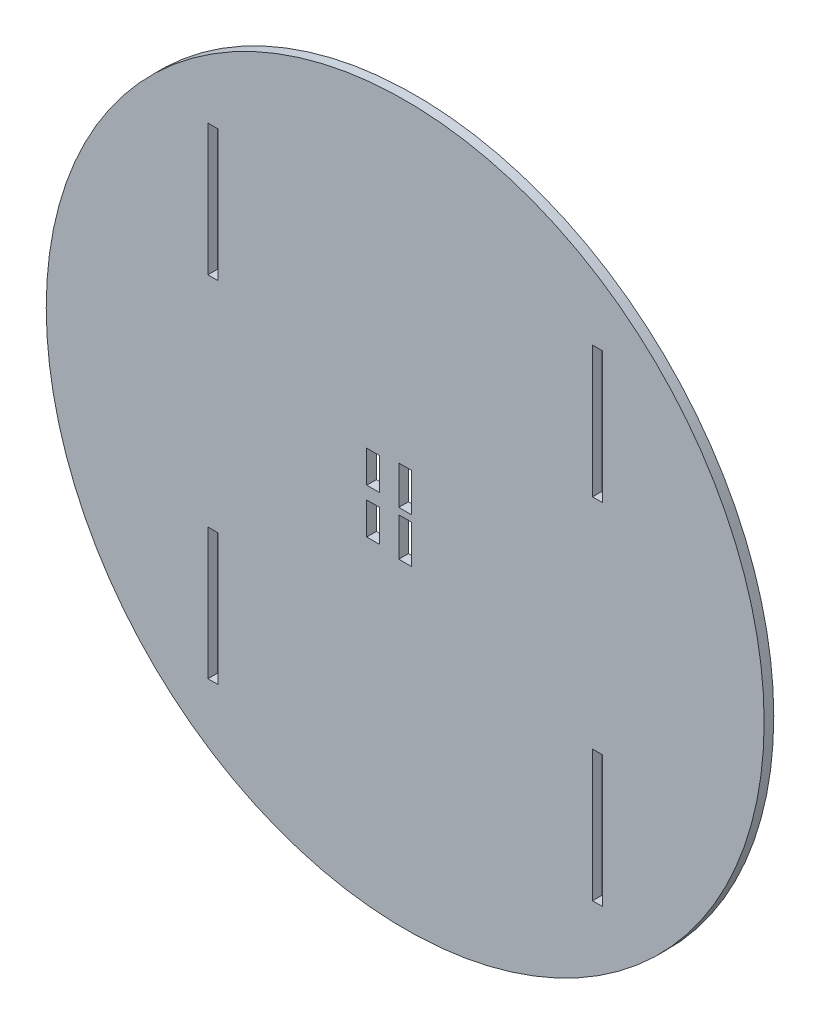
ISO-10303-21;
HEADER;
FILE_DESCRIPTION(('STEP AP214'),'2;1');
FILE_NAME('part.step','',(''),(''),'','','');
FILE_SCHEMA(('AUTOMOTIVE_DESIGN { 1 0 10303 214 1 1 1 1 }'));
ENDSEC;
DATA;
#1=APPLICATION_CONTEXT('core data for automotive mechanical design processes');
#2=APPLICATION_PROTOCOL_DEFINITION('international standard','automotive_design',2000,#1);
#3=PRODUCT_CONTEXT('',#1,'mechanical');
#4=PRODUCT('Part','Part','',(#3));
#5=PRODUCT_RELATED_PRODUCT_CATEGORY('part','',(#4));
#6=PRODUCT_DEFINITION_FORMATION('','',#4);
#7=PRODUCT_DEFINITION_CONTEXT('part definition',#1,'design');
#8=PRODUCT_DEFINITION('design','',#6,#7);
#9=PRODUCT_DEFINITION_SHAPE('','',#8);
#10=(LENGTH_UNIT() NAMED_UNIT(*) SI_UNIT(.MILLI.,.METRE.));
#11=(NAMED_UNIT(*) PLANE_ANGLE_UNIT() SI_UNIT($,.RADIAN.));
#12=(NAMED_UNIT(*) SI_UNIT($,.STERADIAN.) SOLID_ANGLE_UNIT());
#13=UNCERTAINTY_MEASURE_WITH_UNIT(LENGTH_MEASURE(1.E-05),#10,'distance_accuracy_value','');
#14=(GEOMETRIC_REPRESENTATION_CONTEXT(3) GLOBAL_UNCERTAINTY_ASSIGNED_CONTEXT((#13)) GLOBAL_UNIT_ASSIGNED_CONTEXT((#10,
#11,#12)) REPRESENTATION_CONTEXT('',''));
#15=CARTESIAN_POINT('',(0.,0.,0.));
#16=DIRECTION('',(0.,0.,1.));
#17=DIRECTION('',(1.,0.,0.));
#18=AXIS2_PLACEMENT_3D('',#15,#16,#17);
#19=CARTESIAN_POINT('',(0.,0.,1.5));
#20=DIRECTION('',(0.,0.,1.));
#21=DIRECTION('',(1.,0.,0.));
#22=AXIS2_PLACEMENT_3D('',#19,#20,#21);
#23=PLANE('',#22);
#24=CARTESIAN_POINT('',(0.,0.,1.5));
#25=DIRECTION('',(0.,0.,1.));
#26=DIRECTION('',(1.,0.,0.));
#27=AXIS2_PLACEMENT_3D('',#24,#25,#26);
#28=CIRCLE('',#27,112.);
#29=CARTESIAN_POINT('',(112.,0.,1.5));
#30=VERTEX_POINT('',#29);
#31=EDGE_CURVE('E11',#30,#30,#28,.T.);
#32=ORIENTED_EDGE('',*,*,#31,.T.);
#33=EDGE_LOOP('',(#32));
#34=FACE_BOUND('',#33,.T.);
#35=DIRECTION('',(-1.,0.,0.));
#36=VECTOR('',#35,1.);
#37=CARTESIAN_POINT('',(-61.55,75.0727233402951,1.5));
#38=LINE('',#37,#36);
#39=CARTESIAN_POINT('',(-58.45,75.0727233402951,1.5));
#40=VERTEX_POINT('',#39);
#41=CARTESIAN_POINT('',(-61.55,75.0727233402951,1.5));
#42=VERTEX_POINT('',#41);
#43=EDGE_CURVE('E466',#40,#42,#38,.T.);
#44=ORIENTED_EDGE('',*,*,#43,.F.);
#45=DIRECTION('',(0.,1.,0.));
#46=VECTOR('',#45,1.);
#47=CARTESIAN_POINT('',(-58.45,75.0727233402951,1.5));
#48=LINE('',#47,#46);
#49=CARTESIAN_POINT('',(-58.45,34.0727233402951,1.5));
#50=VERTEX_POINT('',#49);
#51=EDGE_CURVE('E464',#50,#40,#48,.T.);
#52=ORIENTED_EDGE('',*,*,#51,.F.);
#53=DIRECTION('',(1.,0.,0.));
#54=VECTOR('',#53,1.);
#55=CARTESIAN_POINT('',(-61.55,34.0727233402951,1.5));
#56=LINE('',#55,#54);
#57=CARTESIAN_POINT('',(-61.55,34.0727233402951,1.5));
#58=VERTEX_POINT('',#57);
#59=EDGE_CURVE('E472',#58,#50,#56,.T.);
#60=ORIENTED_EDGE('',*,*,#59,.F.);
#61=DIRECTION('',(0.,-1.,0.));
#62=VECTOR('',#61,1.);
#63=CARTESIAN_POINT('',(-61.55,75.0727233402951,1.5));
#64=LINE('',#63,#62);
#65=EDGE_CURVE('E469',#42,#58,#64,.T.);
#66=ORIENTED_EDGE('',*,*,#65,.F.);
#67=EDGE_LOOP('',(#44,#52,#60,#66));
#68=FACE_BOUND('',#67,.T.);
#69=DIRECTION('',(-1.,0.,0.));
#70=VECTOR('',#69,1.);
#71=CARTESIAN_POINT('',(-61.55,-34.0727233402951,1.5));
#72=LINE('',#71,#70);
#73=CARTESIAN_POINT('',(-58.45,-34.0727233402951,1.5));
#74=VERTEX_POINT('',#73);
#75=CARTESIAN_POINT('',(-61.55,-34.0727233402951,1.5));
#76=VERTEX_POINT('',#75);
#77=EDGE_CURVE('E435',#74,#76,#72,.T.);
#78=ORIENTED_EDGE('',*,*,#77,.F.);
#79=DIRECTION('',(0.,1.,0.));
#80=VECTOR('',#79,1.);
#81=CARTESIAN_POINT('',(-58.45,-34.0727233402951,1.5));
#82=LINE('',#81,#80);
#83=CARTESIAN_POINT('',(-58.45,-75.0727233402951,1.5));
#84=VERTEX_POINT('',#83);
#85=EDGE_CURVE('E433',#84,#74,#82,.T.);
#86=ORIENTED_EDGE('',*,*,#85,.F.);
#87=DIRECTION('',(1.,0.,0.));
#88=VECTOR('',#87,1.);
#89=CARTESIAN_POINT('',(-61.55,-75.0727233402951,1.5));
#90=LINE('',#89,#88);
#91=CARTESIAN_POINT('',(-61.55,-75.0727233402951,1.5));
#92=VERTEX_POINT('',#91);
#93=EDGE_CURVE('E441',#92,#84,#90,.T.);
#94=ORIENTED_EDGE('',*,*,#93,.F.);
#95=DIRECTION('',(0.,-1.,0.));
#96=VECTOR('',#95,1.);
#97=CARTESIAN_POINT('',(-61.55,-34.0727233402951,1.5));
#98=LINE('',#97,#96);
#99=EDGE_CURVE('E438',#76,#92,#98,.T.);
#100=ORIENTED_EDGE('',*,*,#99,.F.);
#101=EDGE_LOOP('',(#78,#86,#94,#100));
#102=FACE_BOUND('',#101,.T.);
#103=DIRECTION('',(-1.,0.,0.));
#104=VECTOR('',#103,1.);
#105=CARTESIAN_POINT('',(58.45,75.072723340295,1.5));
#106=LINE('',#105,#104);
#107=CARTESIAN_POINT('',(61.55,75.072723340295,1.5));
#108=VERTEX_POINT('',#107);
#109=CARTESIAN_POINT('',(58.45,75.072723340295,1.5));
#110=VERTEX_POINT('',#109);
#111=EDGE_CURVE('E404',#108,#110,#106,.T.);
#112=ORIENTED_EDGE('',*,*,#111,.F.);
#113=DIRECTION('',(0.,1.,0.));
#114=VECTOR('',#113,1.);
#115=CARTESIAN_POINT('',(61.55,75.072723340295,1.5));
#116=LINE('',#115,#114);
#117=CARTESIAN_POINT('',(61.55,34.072723340295,1.5));
#118=VERTEX_POINT('',#117);
#119=EDGE_CURVE('E402',#118,#108,#116,.T.);
#120=ORIENTED_EDGE('',*,*,#119,.F.);
#121=DIRECTION('',(1.,0.,0.));
#122=VECTOR('',#121,1.);
#123=CARTESIAN_POINT('',(58.45,34.072723340295,1.5));
#124=LINE('',#123,#122);
#125=CARTESIAN_POINT('',(58.45,34.072723340295,1.5));
#126=VERTEX_POINT('',#125);
#127=EDGE_CURVE('E410',#126,#118,#124,.T.);
#128=ORIENTED_EDGE('',*,*,#127,.F.);
#129=DIRECTION('',(0.,-1.,0.));
#130=VECTOR('',#129,1.);
#131=CARTESIAN_POINT('',(58.45,75.072723340295,1.5));
#132=LINE('',#131,#130);
#133=EDGE_CURVE('E407',#110,#126,#132,.T.);
#134=ORIENTED_EDGE('',*,*,#133,.F.);
#135=EDGE_LOOP('',(#112,#120,#128,#134));
#136=FACE_BOUND('',#135,.T.);
#137=DIRECTION('',(-1.,0.,0.));
#138=VECTOR('',#137,1.);
#139=CARTESIAN_POINT('',(58.45,-34.0727233402951,1.5));
#140=LINE('',#139,#138);
#141=CARTESIAN_POINT('',(61.55,-34.0727233402951,1.5));
#142=VERTEX_POINT('',#141);
#143=CARTESIAN_POINT('',(58.45,-34.0727233402951,1.5));
#144=VERTEX_POINT('',#143);
#145=EDGE_CURVE('E373',#142,#144,#140,.T.);
#146=ORIENTED_EDGE('',*,*,#145,.F.);
#147=DIRECTION('',(0.,1.,0.));
#148=VECTOR('',#147,1.);
#149=CARTESIAN_POINT('',(61.55,-34.0727233402951,1.5));
#150=LINE('',#149,#148);
#151=CARTESIAN_POINT('',(61.55,-75.0727233402951,1.5));
#152=VERTEX_POINT('',#151);
#153=EDGE_CURVE('E371',#152,#142,#150,.T.);
#154=ORIENTED_EDGE('',*,*,#153,.F.);
#155=DIRECTION('',(1.,0.,0.));
#156=VECTOR('',#155,1.);
#157=CARTESIAN_POINT('',(58.45,-75.0727233402951,1.5));
#158=LINE('',#157,#156);
#159=CARTESIAN_POINT('',(58.45,-75.0727233402951,1.5));
#160=VERTEX_POINT('',#159);
#161=EDGE_CURVE('E379',#160,#152,#158,.T.);
#162=ORIENTED_EDGE('',*,*,#161,.F.);
#163=DIRECTION('',(0.,-1.,0.));
#164=VECTOR('',#163,1.);
#165=CARTESIAN_POINT('',(58.45,-34.0727233402951,1.5));
#166=LINE('',#165,#164);
#167=EDGE_CURVE('E376',#144,#160,#166,.T.);
#168=ORIENTED_EDGE('',*,*,#167,.F.);
#169=EDGE_LOOP('',(#146,#154,#162,#168));
#170=FACE_BOUND('',#169,.T.);
#171=DIRECTION('',(-1.,0.,0.));
#172=VECTOR('',#171,1.);
#173=CARTESIAN_POINT('',(-2.,13.,1.5));
#174=LINE('',#173,#172);
#175=CARTESIAN_POINT('',(2.,13.,1.5));
#176=VERTEX_POINT('',#175);
#177=CARTESIAN_POINT('',(-2.,13.,1.5));
#178=VERTEX_POINT('',#177);
#179=EDGE_CURVE('E342',#176,#178,#174,.T.);
#180=ORIENTED_EDGE('',*,*,#179,.F.);
#181=DIRECTION('',(0.,1.,0.));
#182=VECTOR('',#181,1.);
#183=CARTESIAN_POINT('',(2.,13.,1.5));
#184=LINE('',#183,#182);
#185=CARTESIAN_POINT('',(2.,1.,1.5));
#186=VERTEX_POINT('',#185);
#187=EDGE_CURVE('E340',#186,#176,#184,.T.);
#188=ORIENTED_EDGE('',*,*,#187,.F.);
#189=DIRECTION('',(1.,0.,0.));
#190=VECTOR('',#189,1.);
#191=CARTESIAN_POINT('',(-2.,1.,1.5));
#192=LINE('',#191,#190);
#193=CARTESIAN_POINT('',(-2.,1.,1.5));
#194=VERTEX_POINT('',#193);
#195=EDGE_CURVE('E348',#194,#186,#192,.T.);
#196=ORIENTED_EDGE('',*,*,#195,.F.);
#197=DIRECTION('',(0.,-1.,0.));
#198=VECTOR('',#197,1.);
#199=CARTESIAN_POINT('',(-2.,13.,1.5));
#200=LINE('',#199,#198);
#201=EDGE_CURVE('E345',#178,#194,#200,.T.);
#202=ORIENTED_EDGE('',*,*,#201,.F.);
#203=EDGE_LOOP('',(#180,#188,#196,#202));
#204=FACE_BOUND('',#203,.T.);
#205=DIRECTION('',(-1.,0.,0.));
#206=VECTOR('',#205,1.);
#207=CARTESIAN_POINT('',(-2.,-1.,1.5));
#208=LINE('',#207,#206);
#209=CARTESIAN_POINT('',(2.,-1.,1.5));
#210=VERTEX_POINT('',#209);
#211=CARTESIAN_POINT('',(-2.,-1.,1.5));
#212=VERTEX_POINT('',#211);
#213=EDGE_CURVE('E311',#210,#212,#208,.T.);
#214=ORIENTED_EDGE('',*,*,#213,.F.);
#215=DIRECTION('',(0.,1.,0.));
#216=VECTOR('',#215,1.);
#217=CARTESIAN_POINT('',(2.,-1.,1.5));
#218=LINE('',#217,#216);
#219=CARTESIAN_POINT('',(2.,-13.,1.5));
#220=VERTEX_POINT('',#219);
#221=EDGE_CURVE('E309',#220,#210,#218,.T.);
#222=ORIENTED_EDGE('',*,*,#221,.F.);
#223=DIRECTION('',(1.,0.,0.));
#224=VECTOR('',#223,1.);
#225=CARTESIAN_POINT('',(-2.,-13.,1.5));
#226=LINE('',#225,#224);
#227=CARTESIAN_POINT('',(-2.,-13.,1.5));
#228=VERTEX_POINT('',#227);
#229=EDGE_CURVE('E317',#228,#220,#226,.T.);
#230=ORIENTED_EDGE('',*,*,#229,.F.);
#231=DIRECTION('',(0.,-1.,0.));
#232=VECTOR('',#231,1.);
#233=CARTESIAN_POINT('',(-2.,-1.,1.5));
#234=LINE('',#233,#232);
#235=EDGE_CURVE('E314',#212,#228,#234,.T.);
#236=ORIENTED_EDGE('',*,*,#235,.F.);
#237=EDGE_LOOP('',(#214,#222,#230,#236));
#238=FACE_BOUND('',#237,.T.);
#239=DIRECTION('',(-1.,0.,0.));
#240=VECTOR('',#239,1.);
#241=CARTESIAN_POINT('',(-12.,12.,1.5));
#242=LINE('',#241,#240);
#243=CARTESIAN_POINT('',(-8.,12.,1.5));
#244=VERTEX_POINT('',#243);
#245=CARTESIAN_POINT('',(-12.,12.,1.5));
#246=VERTEX_POINT('',#245);
#247=EDGE_CURVE('E280',#244,#246,#242,.T.);
#248=ORIENTED_EDGE('',*,*,#247,.F.);
#249=DIRECTION('',(0.,1.,0.));
#250=VECTOR('',#249,1.);
#251=CARTESIAN_POINT('',(-8.,12.,1.5));
#252=LINE('',#251,#250);
#253=CARTESIAN_POINT('',(-8.,2.,1.5));
#254=VERTEX_POINT('',#253);
#255=EDGE_CURVE('E278',#254,#244,#252,.T.);
#256=ORIENTED_EDGE('',*,*,#255,.F.);
#257=DIRECTION('',(1.,0.,0.));
#258=VECTOR('',#257,1.);
#259=CARTESIAN_POINT('',(-12.,2.,1.5));
#260=LINE('',#259,#258);
#261=CARTESIAN_POINT('',(-12.,2.,1.5));
#262=VERTEX_POINT('',#261);
#263=EDGE_CURVE('E286',#262,#254,#260,.T.);
#264=ORIENTED_EDGE('',*,*,#263,.F.);
#265=DIRECTION('',(0.,-1.,0.));
#266=VECTOR('',#265,1.);
#267=CARTESIAN_POINT('',(-12.,12.,1.5));
#268=LINE('',#267,#266);
#269=EDGE_CURVE('E283',#246,#262,#268,.T.);
#270=ORIENTED_EDGE('',*,*,#269,.F.);
#271=EDGE_LOOP('',(#248,#256,#264,#270));
#272=FACE_BOUND('',#271,.T.);
#273=DIRECTION('',(-1.,0.,0.));
#274=VECTOR('',#273,1.);
#275=CARTESIAN_POINT('',(-12.,-2.,1.5));
#276=LINE('',#275,#274);
#277=CARTESIAN_POINT('',(-8.,-2.,1.5));
#278=VERTEX_POINT('',#277);
#279=CARTESIAN_POINT('',(-12.,-2.,1.5));
#280=VERTEX_POINT('',#279);
#281=EDGE_CURVE('E250',#278,#280,#276,.T.);
#282=ORIENTED_EDGE('',*,*,#281,.F.);
#283=DIRECTION('',(0.,1.,0.));
#284=VECTOR('',#283,1.);
#285=CARTESIAN_POINT('',(-8.,-2.,1.5));
#286=LINE('',#285,#284);
#287=CARTESIAN_POINT('',(-8.,-12.,1.5));
#288=VERTEX_POINT('',#287);
#289=EDGE_CURVE('E242',#288,#278,#286,.T.);
#290=ORIENTED_EDGE('',*,*,#289,.F.);
#291=DIRECTION('',(1.,0.,0.));
#292=VECTOR('',#291,1.);
#293=CARTESIAN_POINT('',(-12.,-12.,1.5));
#294=LINE('',#293,#292);
#295=CARTESIAN_POINT('',(-12.,-12.,1.5));
#296=VERTEX_POINT('',#295);
#297=EDGE_CURVE('E264',#296,#288,#294,.T.);
#298=ORIENTED_EDGE('',*,*,#297,.F.);
#299=DIRECTION('',(0.,-1.,0.));
#300=VECTOR('',#299,1.);
#301=CARTESIAN_POINT('',(-12.,-2.,1.5));
#302=LINE('',#301,#300);
#303=EDGE_CURVE('E262',#280,#296,#302,.T.);
#304=ORIENTED_EDGE('',*,*,#303,.F.);
#305=EDGE_LOOP('',(#282,#290,#298,#304));
#306=FACE_BOUND('',#305,.T.);
#307=ADVANCED_FACE('F33',(#34,#68,#102,#136,#170,#204,#238,#272,#306),#23,.T.);
#308=CARTESIAN_POINT('',(0.,0.,-1.5));
#309=DIRECTION('',(0.,0.,1.));
#310=DIRECTION('',(1.,0.,0.));
#311=AXIS2_PLACEMENT_3D('',#308,#309,#310);
#312=PLANE('',#311);
#313=DIRECTION('',(0.,1.,0.));
#314=VECTOR('',#313,1.);
#315=CARTESIAN_POINT('',(-8.,12.,-1.5));
#316=LINE('',#315,#314);
#317=CARTESIAN_POINT('',(-8.,2.,-1.5));
#318=VERTEX_POINT('',#317);
#319=CARTESIAN_POINT('',(-8.,12.,-1.5));
#320=VERTEX_POINT('',#319);
#321=EDGE_CURVE('E258',#318,#320,#316,.T.);
#322=ORIENTED_EDGE('',*,*,#321,.T.);
#323=DIRECTION('',(-1.,0.,0.));
#324=VECTOR('',#323,1.);
#325=CARTESIAN_POINT('',(-12.,12.,-1.5));
#326=LINE('',#325,#324);
#327=CARTESIAN_POINT('',(-12.,12.,-1.5));
#328=VERTEX_POINT('',#327);
#329=EDGE_CURVE('E291',#320,#328,#326,.T.);
#330=ORIENTED_EDGE('',*,*,#329,.T.);
#331=DIRECTION('',(0.,-1.,0.));
#332=VECTOR('',#331,1.);
#333=CARTESIAN_POINT('',(-12.,12.,-1.5));
#334=LINE('',#333,#332);
#335=CARTESIAN_POINT('',(-12.,2.,-1.5));
#336=VERTEX_POINT('',#335);
#337=EDGE_CURVE('E294',#328,#336,#334,.T.);
#338=ORIENTED_EDGE('',*,*,#337,.T.);
#339=DIRECTION('',(1.,0.,0.));
#340=VECTOR('',#339,1.);
#341=CARTESIAN_POINT('',(-12.,2.,-1.5));
#342=LINE('',#341,#340);
#343=EDGE_CURVE('E281',#336,#318,#342,.T.);
#344=ORIENTED_EDGE('',*,*,#343,.T.);
#345=EDGE_LOOP('',(#322,#330,#338,#344));
#346=FACE_BOUND('',#345,.T.);
#347=DIRECTION('',(0.,1.,0.));
#348=VECTOR('',#347,1.);
#349=CARTESIAN_POINT('',(2.,13.,-1.5));
#350=LINE('',#349,#348);
#351=CARTESIAN_POINT('',(2.,1.,-1.5));
#352=VERTEX_POINT('',#351);
#353=CARTESIAN_POINT('',(2.,13.,-1.5));
#354=VERTEX_POINT('',#353);
#355=EDGE_CURVE('E339',#352,#354,#350,.T.);
#356=ORIENTED_EDGE('',*,*,#355,.T.);
#357=DIRECTION('',(-1.,0.,0.));
#358=VECTOR('',#357,1.);
#359=CARTESIAN_POINT('',(-2.,13.,-1.5));
#360=LINE('',#359,#358);
#361=CARTESIAN_POINT('',(-2.,13.,-1.5));
#362=VERTEX_POINT('',#361);
#363=EDGE_CURVE('E353',#354,#362,#360,.T.);
#364=ORIENTED_EDGE('',*,*,#363,.T.);
#365=DIRECTION('',(0.,-1.,0.));
#366=VECTOR('',#365,1.);
#367=CARTESIAN_POINT('',(-2.,13.,-1.5));
#368=LINE('',#367,#366);
#369=CARTESIAN_POINT('',(-2.,1.,-1.5));
#370=VERTEX_POINT('',#369);
#371=EDGE_CURVE('E356',#362,#370,#368,.T.);
#372=ORIENTED_EDGE('',*,*,#371,.T.);
#373=DIRECTION('',(1.,0.,0.));
#374=VECTOR('',#373,1.);
#375=CARTESIAN_POINT('',(-2.,1.,-1.5));
#376=LINE('',#375,#374);
#377=EDGE_CURVE('E343',#370,#352,#376,.T.);
#378=ORIENTED_EDGE('',*,*,#377,.T.);
#379=EDGE_LOOP('',(#356,#364,#372,#378));
#380=FACE_BOUND('',#379,.T.);
#381=DIRECTION('',(0.,1.,0.));
#382=VECTOR('',#381,1.);
#383=CARTESIAN_POINT('',(61.55,75.072723340295,-1.5));
#384=LINE('',#383,#382);
#385=CARTESIAN_POINT('',(61.55,34.072723340295,-1.5));
#386=VERTEX_POINT('',#385);
#387=CARTESIAN_POINT('',(61.55,75.072723340295,-1.5));
#388=VERTEX_POINT('',#387);
#389=EDGE_CURVE('E401',#386,#388,#384,.T.);
#390=ORIENTED_EDGE('',*,*,#389,.T.);
#391=DIRECTION('',(-1.,0.,0.));
#392=VECTOR('',#391,1.);
#393=CARTESIAN_POINT('',(58.45,75.072723340295,-1.5));
#394=LINE('',#393,#392);
#395=CARTESIAN_POINT('',(58.45,75.072723340295,-1.5));
#396=VERTEX_POINT('',#395);
#397=EDGE_CURVE('E415',#388,#396,#394,.T.);
#398=ORIENTED_EDGE('',*,*,#397,.T.);
#399=DIRECTION('',(0.,-1.,0.));
#400=VECTOR('',#399,1.);
#401=CARTESIAN_POINT('',(58.45,75.072723340295,-1.5));
#402=LINE('',#401,#400);
#403=CARTESIAN_POINT('',(58.45,34.072723340295,-1.5));
#404=VERTEX_POINT('',#403);
#405=EDGE_CURVE('E418',#396,#404,#402,.T.);
#406=ORIENTED_EDGE('',*,*,#405,.T.);
#407=DIRECTION('',(1.,0.,0.));
#408=VECTOR('',#407,1.);
#409=CARTESIAN_POINT('',(58.45,34.072723340295,-1.5));
#410=LINE('',#409,#408);
#411=EDGE_CURVE('E405',#404,#386,#410,.T.);
#412=ORIENTED_EDGE('',*,*,#411,.T.);
#413=EDGE_LOOP('',(#390,#398,#406,#412));
#414=FACE_BOUND('',#413,.T.);
#415=DIRECTION('',(0.,1.,0.));
#416=VECTOR('',#415,1.);
#417=CARTESIAN_POINT('',(-58.45,75.0727233402951,-1.5));
#418=LINE('',#417,#416);
#419=CARTESIAN_POINT('',(-58.45,34.0727233402951,-1.5));
#420=VERTEX_POINT('',#419);
#421=CARTESIAN_POINT('',(-58.45,75.0727233402951,-1.5));
#422=VERTEX_POINT('',#421);
#423=EDGE_CURVE('E463',#420,#422,#418,.T.);
#424=ORIENTED_EDGE('',*,*,#423,.T.);
#425=DIRECTION('',(-1.,0.,0.));
#426=VECTOR('',#425,1.);
#427=CARTESIAN_POINT('',(-61.55,75.0727233402951,-1.5));
#428=LINE('',#427,#426);
#429=CARTESIAN_POINT('',(-61.55,75.0727233402951,-1.5));
#430=VERTEX_POINT('',#429);
#431=EDGE_CURVE('E477',#422,#430,#428,.T.);
#432=ORIENTED_EDGE('',*,*,#431,.T.);
#433=DIRECTION('',(0.,-1.,0.));
#434=VECTOR('',#433,1.);
#435=CARTESIAN_POINT('',(-61.55,75.0727233402951,-1.5));
#436=LINE('',#435,#434);
#437=CARTESIAN_POINT('',(-61.55,34.0727233402951,-1.5));
#438=VERTEX_POINT('',#437);
#439=EDGE_CURVE('E480',#430,#438,#436,.T.);
#440=ORIENTED_EDGE('',*,*,#439,.T.);
#441=DIRECTION('',(1.,0.,0.));
#442=VECTOR('',#441,1.);
#443=CARTESIAN_POINT('',(-61.55,34.0727233402951,-1.5));
#444=LINE('',#443,#442);
#445=EDGE_CURVE('E467',#438,#420,#444,.T.);
#446=ORIENTED_EDGE('',*,*,#445,.T.);
#447=EDGE_LOOP('',(#424,#432,#440,#446));
#448=FACE_BOUND('',#447,.T.);
#449=CARTESIAN_POINT('',(0.,0.,-1.5));
#450=DIRECTION('',(0.,0.,1.));
#451=DIRECTION('',(1.,0.,0.));
#452=AXIS2_PLACEMENT_3D('',#449,#450,#451);
#453=CIRCLE('',#452,112.);
#454=CARTESIAN_POINT('',(112.,0.,-1.5));
#455=VERTEX_POINT('',#454);
#456=EDGE_CURVE('E37',#455,#455,#453,.T.);
#457=ORIENTED_EDGE('',*,*,#456,.F.);
#458=EDGE_LOOP('',(#457));
#459=FACE_BOUND('',#458,.T.);
#460=DIRECTION('',(0.,1.,0.));
#461=VECTOR('',#460,1.);
#462=CARTESIAN_POINT('',(-58.45,-34.0727233402951,-1.5));
#463=LINE('',#462,#461);
#464=CARTESIAN_POINT('',(-58.45,-75.0727233402951,-1.5));
#465=VERTEX_POINT('',#464);
#466=CARTESIAN_POINT('',(-58.45,-34.0727233402951,-1.5));
#467=VERTEX_POINT('',#466);
#468=EDGE_CURVE('E432',#465,#467,#463,.T.);
#469=ORIENTED_EDGE('',*,*,#468,.T.);
#470=DIRECTION('',(-1.,0.,0.));
#471=VECTOR('',#470,1.);
#472=CARTESIAN_POINT('',(-61.55,-34.0727233402951,-1.5));
#473=LINE('',#472,#471);
#474=CARTESIAN_POINT('',(-61.55,-34.0727233402951,-1.5));
#475=VERTEX_POINT('',#474);
#476=EDGE_CURVE('E446',#467,#475,#473,.T.);
#477=ORIENTED_EDGE('',*,*,#476,.T.);
#478=DIRECTION('',(0.,-1.,0.));
#479=VECTOR('',#478,1.);
#480=CARTESIAN_POINT('',(-61.55,-34.0727233402951,-1.5));
#481=LINE('',#480,#479);
#482=CARTESIAN_POINT('',(-61.55,-75.0727233402951,-1.5));
#483=VERTEX_POINT('',#482);
#484=EDGE_CURVE('E449',#475,#483,#481,.T.);
#485=ORIENTED_EDGE('',*,*,#484,.T.);
#486=DIRECTION('',(1.,0.,0.));
#487=VECTOR('',#486,1.);
#488=CARTESIAN_POINT('',(-61.55,-75.0727233402951,-1.5));
#489=LINE('',#488,#487);
#490=EDGE_CURVE('E436',#483,#465,#489,.T.);
#491=ORIENTED_EDGE('',*,*,#490,.T.);
#492=EDGE_LOOP('',(#469,#477,#485,#491));
#493=FACE_BOUND('',#492,.T.);
#494=DIRECTION('',(0.,1.,0.));
#495=VECTOR('',#494,1.);
#496=CARTESIAN_POINT('',(61.55,-34.0727233402951,-1.5));
#497=LINE('',#496,#495);
#498=CARTESIAN_POINT('',(61.55,-75.0727233402951,-1.5));
#499=VERTEX_POINT('',#498);
#500=CARTESIAN_POINT('',(61.55,-34.0727233402951,-1.5));
#501=VERTEX_POINT('',#500);
#502=EDGE_CURVE('E370',#499,#501,#497,.T.);
#503=ORIENTED_EDGE('',*,*,#502,.T.);
#504=DIRECTION('',(-1.,0.,0.));
#505=VECTOR('',#504,1.);
#506=CARTESIAN_POINT('',(58.45,-34.0727233402951,-1.5));
#507=LINE('',#506,#505);
#508=CARTESIAN_POINT('',(58.45,-34.0727233402951,-1.5));
#509=VERTEX_POINT('',#508);
#510=EDGE_CURVE('E384',#501,#509,#507,.T.);
#511=ORIENTED_EDGE('',*,*,#510,.T.);
#512=DIRECTION('',(0.,-1.,0.));
#513=VECTOR('',#512,1.);
#514=CARTESIAN_POINT('',(58.45,-34.0727233402951,-1.5));
#515=LINE('',#514,#513);
#516=CARTESIAN_POINT('',(58.45,-75.0727233402951,-1.5));
#517=VERTEX_POINT('',#516);
#518=EDGE_CURVE('E387',#509,#517,#515,.T.);
#519=ORIENTED_EDGE('',*,*,#518,.T.);
#520=DIRECTION('',(1.,0.,0.));
#521=VECTOR('',#520,1.);
#522=CARTESIAN_POINT('',(58.45,-75.0727233402951,-1.5));
#523=LINE('',#522,#521);
#524=EDGE_CURVE('E374',#517,#499,#523,.T.);
#525=ORIENTED_EDGE('',*,*,#524,.T.);
#526=EDGE_LOOP('',(#503,#511,#519,#525));
#527=FACE_BOUND('',#526,.T.);
#528=DIRECTION('',(0.,1.,0.));
#529=VECTOR('',#528,1.);
#530=CARTESIAN_POINT('',(2.,-1.,-1.5));
#531=LINE('',#530,#529);
#532=CARTESIAN_POINT('',(2.,-13.,-1.5));
#533=VERTEX_POINT('',#532);
#534=CARTESIAN_POINT('',(2.,-1.,-1.5));
#535=VERTEX_POINT('',#534);
#536=EDGE_CURVE('E308',#533,#535,#531,.T.);
#537=ORIENTED_EDGE('',*,*,#536,.T.);
#538=DIRECTION('',(-1.,0.,0.));
#539=VECTOR('',#538,1.);
#540=CARTESIAN_POINT('',(-2.,-1.,-1.5));
#541=LINE('',#540,#539);
#542=CARTESIAN_POINT('',(-2.,-1.,-1.5));
#543=VERTEX_POINT('',#542);
#544=EDGE_CURVE('E322',#535,#543,#541,.T.);
#545=ORIENTED_EDGE('',*,*,#544,.T.);
#546=DIRECTION('',(0.,-1.,0.));
#547=VECTOR('',#546,1.);
#548=CARTESIAN_POINT('',(-2.,-1.,-1.5));
#549=LINE('',#548,#547);
#550=CARTESIAN_POINT('',(-2.,-13.,-1.5));
#551=VERTEX_POINT('',#550);
#552=EDGE_CURVE('E325',#543,#551,#549,.T.);
#553=ORIENTED_EDGE('',*,*,#552,.T.);
#554=DIRECTION('',(1.,0.,0.));
#555=VECTOR('',#554,1.);
#556=CARTESIAN_POINT('',(-2.,-13.,-1.5));
#557=LINE('',#556,#555);
#558=EDGE_CURVE('E312',#551,#533,#557,.T.);
#559=ORIENTED_EDGE('',*,*,#558,.T.);
#560=EDGE_LOOP('',(#537,#545,#553,#559));
#561=FACE_BOUND('',#560,.T.);
#562=DIRECTION('',(0.,1.,0.));
#563=VECTOR('',#562,1.);
#564=CARTESIAN_POINT('',(-8.,-2.,-1.5));
#565=LINE('',#564,#563);
#566=CARTESIAN_POINT('',(-8.,-12.,-1.5));
#567=VERTEX_POINT('',#566);
#568=CARTESIAN_POINT('',(-8.,-2.,-1.5));
#569=VERTEX_POINT('',#568);
#570=EDGE_CURVE('E56',#567,#569,#565,.T.);
#571=ORIENTED_EDGE('',*,*,#570,.T.);
#572=DIRECTION('',(-1.,0.,0.));
#573=VECTOR('',#572,1.);
#574=CARTESIAN_POINT('',(-12.,-2.,-1.5));
#575=LINE('',#574,#573);
#576=CARTESIAN_POINT('',(-12.,-2.,-1.5));
#577=VERTEX_POINT('',#576);
#578=EDGE_CURVE('E257',#569,#577,#575,.T.);
#579=ORIENTED_EDGE('',*,*,#578,.T.);
#580=DIRECTION('',(0.,-1.,0.));
#581=VECTOR('',#580,1.);
#582=CARTESIAN_POINT('',(-12.,-2.,-1.5));
#583=LINE('',#582,#581);
#584=CARTESIAN_POINT('',(-12.,-12.,-1.5));
#585=VERTEX_POINT('',#584);
#586=EDGE_CURVE('E270',#577,#585,#583,.T.);
#587=ORIENTED_EDGE('',*,*,#586,.T.);
#588=DIRECTION('',(1.,0.,0.));
#589=VECTOR('',#588,1.);
#590=CARTESIAN_POINT('',(-12.,-12.,-1.5));
#591=LINE('',#590,#589);
#592=EDGE_CURVE('E251',#585,#567,#591,.T.);
#593=ORIENTED_EDGE('',*,*,#592,.T.);
#594=EDGE_LOOP('',(#571,#579,#587,#593));
#595=FACE_BOUND('',#594,.T.);
#596=ADVANCED_FACE('F499',(#346,#380,#414,#448,#459,#493,#527,#561,#595),#312,.F.);
#597=CARTESIAN_POINT('',(0.,0.,1.5));
#598=DIRECTION('',(0.,0.,-1.));
#599=DIRECTION('',(-1.,0.,0.));
#600=AXIS2_PLACEMENT_3D('',#597,#598,#599);
#601=CYLINDRICAL_SURFACE('',#600,112.);
#602=ORIENTED_EDGE('',*,*,#31,.F.);
#603=EDGE_LOOP('',(#602));
#604=FACE_BOUND('',#603,.T.);
#605=ORIENTED_EDGE('',*,*,#456,.T.);
#606=EDGE_LOOP('',(#605));
#607=FACE_BOUND('',#606,.T.);
#608=ADVANCED_FACE('F35',(#604,#607),#601,.T.);
#609=CARTESIAN_POINT('',(-58.45,75.0727233402951,1.5));
#610=DIRECTION('',(-1.,0.,0.));
#611=DIRECTION('',(0.,-1.,0.));
#612=AXIS2_PLACEMENT_3D('',#609,#610,#611);
#613=PLANE('',#612);
#614=ORIENTED_EDGE('',*,*,#423,.F.);
#615=DIRECTION('',(0.,0.,-1.));
#616=VECTOR('',#615,1.);
#617=CARTESIAN_POINT('',(-58.45,34.0727233402951,1.5));
#618=LINE('',#617,#616);
#619=EDGE_CURVE('E474',#50,#420,#618,.T.);
#620=ORIENTED_EDGE('',*,*,#619,.F.);
#621=ORIENTED_EDGE('',*,*,#51,.T.);
#622=DIRECTION('',(0.,0.,-1.));
#623=VECTOR('',#622,1.);
#624=CARTESIAN_POINT('',(-58.45,75.0727233402951,1.5));
#625=LINE('',#624,#623);
#626=EDGE_CURVE('E491',#40,#422,#625,.T.);
#627=ORIENTED_EDGE('',*,*,#626,.T.);
#628=EDGE_LOOP('',(#614,#620,#621,#627));
#629=FACE_BOUND('',#628,.T.);
#630=ADVANCED_FACE('F523',(#629),#613,.T.);
#631=CARTESIAN_POINT('',(-61.55,75.0727233402951,1.5));
#632=DIRECTION('',(0.,-1.,0.));
#633=DIRECTION('',(0.,0.,-1.));
#634=AXIS2_PLACEMENT_3D('',#631,#632,#633);
#635=PLANE('',#634);
#636=ORIENTED_EDGE('',*,*,#431,.F.);
#637=ORIENTED_EDGE('',*,*,#626,.F.);
#638=ORIENTED_EDGE('',*,*,#43,.T.);
#639=DIRECTION('',(0.,0.,-1.));
#640=VECTOR('',#639,1.);
#641=CARTESIAN_POINT('',(-61.55,75.0727233402951,1.5));
#642=LINE('',#641,#640);
#643=EDGE_CURVE('E489',#42,#430,#642,.T.);
#644=ORIENTED_EDGE('',*,*,#643,.T.);
#645=EDGE_LOOP('',(#636,#637,#638,#644));
#646=FACE_BOUND('',#645,.T.);
#647=ADVANCED_FACE('F526',(#646),#635,.T.);
#648=CARTESIAN_POINT('',(-61.55,75.0727233402951,1.5));
#649=DIRECTION('',(1.,0.,0.));
#650=DIRECTION('',(0.,1.,0.));
#651=AXIS2_PLACEMENT_3D('',#648,#649,#650);
#652=PLANE('',#651);
#653=ORIENTED_EDGE('',*,*,#439,.F.);
#654=ORIENTED_EDGE('',*,*,#643,.F.);
#655=ORIENTED_EDGE('',*,*,#65,.T.);
#656=DIRECTION('',(0.,0.,-1.));
#657=VECTOR('',#656,1.);
#658=CARTESIAN_POINT('',(-61.55,34.0727233402951,1.5));
#659=LINE('',#658,#657);
#660=EDGE_CURVE('E487',#58,#438,#659,.T.);
#661=ORIENTED_EDGE('',*,*,#660,.T.);
#662=EDGE_LOOP('',(#653,#654,#655,#661));
#663=FACE_BOUND('',#662,.T.);
#664=ADVANCED_FACE('F529',(#663),#652,.T.);
#665=CARTESIAN_POINT('',(-61.55,34.0727233402951,1.5));
#666=DIRECTION('',(0.,1.,0.));
#667=DIRECTION('',(0.,0.,1.));
#668=AXIS2_PLACEMENT_3D('',#665,#666,#667);
#669=PLANE('',#668);
#670=ORIENTED_EDGE('',*,*,#445,.F.);
#671=ORIENTED_EDGE('',*,*,#660,.F.);
#672=ORIENTED_EDGE('',*,*,#59,.T.);
#673=ORIENTED_EDGE('',*,*,#619,.T.);
#674=EDGE_LOOP('',(#670,#671,#672,#673));
#675=FACE_BOUND('',#674,.T.);
#676=ADVANCED_FACE('F533',(#675),#669,.T.);
#677=CARTESIAN_POINT('',(-58.45,-34.0727233402951,1.5));
#678=DIRECTION('',(-1.,0.,0.));
#679=DIRECTION('',(0.,-1.,0.));
#680=AXIS2_PLACEMENT_3D('',#677,#678,#679);
#681=PLANE('',#680);
#682=ORIENTED_EDGE('',*,*,#468,.F.);
#683=DIRECTION('',(0.,0.,-1.));
#684=VECTOR('',#683,1.);
#685=CARTESIAN_POINT('',(-58.45,-75.0727233402951,1.5));
#686=LINE('',#685,#684);
#687=EDGE_CURVE('E443',#84,#465,#686,.T.);
#688=ORIENTED_EDGE('',*,*,#687,.F.);
#689=ORIENTED_EDGE('',*,*,#85,.T.);
#690=DIRECTION('',(0.,0.,-1.));
#691=VECTOR('',#690,1.);
#692=CARTESIAN_POINT('',(-58.45,-34.0727233402951,1.5));
#693=LINE('',#692,#691);
#694=EDGE_CURVE('E460',#74,#467,#693,.T.);
#695=ORIENTED_EDGE('',*,*,#694,.T.);
#696=EDGE_LOOP('',(#682,#688,#689,#695));
#697=FACE_BOUND('',#696,.T.);
#698=ADVANCED_FACE('F537',(#697),#681,.T.);
#699=CARTESIAN_POINT('',(-61.55,-34.0727233402951,1.5));
#700=DIRECTION('',(0.,-1.,0.));
#701=DIRECTION('',(0.,0.,-1.));
#702=AXIS2_PLACEMENT_3D('',#699,#700,#701);
#703=PLANE('',#702);
#704=ORIENTED_EDGE('',*,*,#476,.F.);
#705=ORIENTED_EDGE('',*,*,#694,.F.);
#706=ORIENTED_EDGE('',*,*,#77,.T.);
#707=DIRECTION('',(0.,0.,-1.));
#708=VECTOR('',#707,1.);
#709=CARTESIAN_POINT('',(-61.55,-34.0727233402951,1.5));
#710=LINE('',#709,#708);
#711=EDGE_CURVE('E458',#76,#475,#710,.T.);
#712=ORIENTED_EDGE('',*,*,#711,.T.);
#713=EDGE_LOOP('',(#704,#705,#706,#712));
#714=FACE_BOUND('',#713,.T.);
#715=ADVANCED_FACE('F541',(#714),#703,.T.);
#716=CARTESIAN_POINT('',(-61.55,-34.0727233402951,1.5));
#717=DIRECTION('',(1.,0.,0.));
#718=DIRECTION('',(0.,1.,0.));
#719=AXIS2_PLACEMENT_3D('',#716,#717,#718);
#720=PLANE('',#719);
#721=ORIENTED_EDGE('',*,*,#484,.F.);
#722=ORIENTED_EDGE('',*,*,#711,.F.);
#723=ORIENTED_EDGE('',*,*,#99,.T.);
#724=DIRECTION('',(0.,0.,-1.));
#725=VECTOR('',#724,1.);
#726=CARTESIAN_POINT('',(-61.55,-75.0727233402951,1.5));
#727=LINE('',#726,#725);
#728=EDGE_CURVE('E456',#92,#483,#727,.T.);
#729=ORIENTED_EDGE('',*,*,#728,.T.);
#730=EDGE_LOOP('',(#721,#722,#723,#729));
#731=FACE_BOUND('',#730,.T.);
#732=ADVANCED_FACE('F545',(#731),#720,.T.);
#733=CARTESIAN_POINT('',(-61.55,-75.0727233402951,1.5));
#734=DIRECTION('',(0.,1.,0.));
#735=DIRECTION('',(0.,0.,1.));
#736=AXIS2_PLACEMENT_3D('',#733,#734,#735);
#737=PLANE('',#736);
#738=ORIENTED_EDGE('',*,*,#490,.F.);
#739=ORIENTED_EDGE('',*,*,#728,.F.);
#740=ORIENTED_EDGE('',*,*,#93,.T.);
#741=ORIENTED_EDGE('',*,*,#687,.T.);
#742=EDGE_LOOP('',(#738,#739,#740,#741));
#743=FACE_BOUND('',#742,.T.);
#744=ADVANCED_FACE('F549',(#743),#737,.T.);
#745=CARTESIAN_POINT('',(61.55,75.072723340295,1.5));
#746=DIRECTION('',(-1.,0.,0.));
#747=DIRECTION('',(0.,-1.,0.));
#748=AXIS2_PLACEMENT_3D('',#745,#746,#747);
#749=PLANE('',#748);
#750=ORIENTED_EDGE('',*,*,#389,.F.);
#751=DIRECTION('',(0.,0.,-1.));
#752=VECTOR('',#751,1.);
#753=CARTESIAN_POINT('',(61.55,34.072723340295,1.5));
#754=LINE('',#753,#752);
#755=EDGE_CURVE('E412',#118,#386,#754,.T.);
#756=ORIENTED_EDGE('',*,*,#755,.F.);
#757=ORIENTED_EDGE('',*,*,#119,.T.);
#758=DIRECTION('',(0.,0.,-1.));
#759=VECTOR('',#758,1.);
#760=CARTESIAN_POINT('',(61.55,75.072723340295,1.5));
#761=LINE('',#760,#759);
#762=EDGE_CURVE('E429',#108,#388,#761,.T.);
#763=ORIENTED_EDGE('',*,*,#762,.T.);
#764=EDGE_LOOP('',(#750,#756,#757,#763));
#765=FACE_BOUND('',#764,.T.);
#766=ADVANCED_FACE('F553',(#765),#749,.T.);
#767=CARTESIAN_POINT('',(58.45,75.072723340295,1.5));
#768=DIRECTION('',(0.,-1.,0.));
#769=DIRECTION('',(0.,0.,-1.));
#770=AXIS2_PLACEMENT_3D('',#767,#768,#769);
#771=PLANE('',#770);
#772=ORIENTED_EDGE('',*,*,#397,.F.);
#773=ORIENTED_EDGE('',*,*,#762,.F.);
#774=ORIENTED_EDGE('',*,*,#111,.T.);
#775=DIRECTION('',(0.,0.,-1.));
#776=VECTOR('',#775,1.);
#777=CARTESIAN_POINT('',(58.45,75.072723340295,1.5));
#778=LINE('',#777,#776);
#779=EDGE_CURVE('E427',#110,#396,#778,.T.);
#780=ORIENTED_EDGE('',*,*,#779,.T.);
#781=EDGE_LOOP('',(#772,#773,#774,#780));
#782=FACE_BOUND('',#781,.T.);
#783=ADVANCED_FACE('F557',(#782),#771,.T.);
#784=CARTESIAN_POINT('',(58.45,75.072723340295,1.5));
#785=DIRECTION('',(1.,0.,0.));
#786=DIRECTION('',(0.,1.,0.));
#787=AXIS2_PLACEMENT_3D('',#784,#785,#786);
#788=PLANE('',#787);
#789=ORIENTED_EDGE('',*,*,#405,.F.);
#790=ORIENTED_EDGE('',*,*,#779,.F.);
#791=ORIENTED_EDGE('',*,*,#133,.T.);
#792=DIRECTION('',(0.,0.,-1.));
#793=VECTOR('',#792,1.);
#794=CARTESIAN_POINT('',(58.45,34.072723340295,1.5));
#795=LINE('',#794,#793);
#796=EDGE_CURVE('E425',#126,#404,#795,.T.);
#797=ORIENTED_EDGE('',*,*,#796,.T.);
#798=EDGE_LOOP('',(#789,#790,#791,#797));
#799=FACE_BOUND('',#798,.T.);
#800=ADVANCED_FACE('F561',(#799),#788,.T.);
#801=CARTESIAN_POINT('',(58.45,34.072723340295,1.5));
#802=DIRECTION('',(0.,1.,0.));
#803=DIRECTION('',(0.,0.,1.));
#804=AXIS2_PLACEMENT_3D('',#801,#802,#803);
#805=PLANE('',#804);
#806=ORIENTED_EDGE('',*,*,#411,.F.);
#807=ORIENTED_EDGE('',*,*,#796,.F.);
#808=ORIENTED_EDGE('',*,*,#127,.T.);
#809=ORIENTED_EDGE('',*,*,#755,.T.);
#810=EDGE_LOOP('',(#806,#807,#808,#809));
#811=FACE_BOUND('',#810,.T.);
#812=ADVANCED_FACE('F565',(#811),#805,.T.);
#813=CARTESIAN_POINT('',(61.55,-34.0727233402951,1.5));
#814=DIRECTION('',(-1.,0.,0.));
#815=DIRECTION('',(0.,0.,1.));
#816=AXIS2_PLACEMENT_3D('',#813,#814,#815);
#817=PLANE('',#816);
#818=ORIENTED_EDGE('',*,*,#502,.F.);
#819=DIRECTION('',(0.,0.,-1.));
#820=VECTOR('',#819,1.);
#821=CARTESIAN_POINT('',(61.55,-75.0727233402951,1.5));
#822=LINE('',#821,#820);
#823=EDGE_CURVE('E381',#152,#499,#822,.T.);
#824=ORIENTED_EDGE('',*,*,#823,.F.);
#825=ORIENTED_EDGE('',*,*,#153,.T.);
#826=DIRECTION('',(0.,0.,-1.));
#827=VECTOR('',#826,1.);
#828=CARTESIAN_POINT('',(61.55,-34.0727233402951,1.5));
#829=LINE('',#828,#827);
#830=EDGE_CURVE('E398',#142,#501,#829,.T.);
#831=ORIENTED_EDGE('',*,*,#830,.T.);
#832=EDGE_LOOP('',(#818,#824,#825,#831));
#833=FACE_BOUND('',#832,.T.);
#834=ADVANCED_FACE('F569',(#833),#817,.T.);
#835=CARTESIAN_POINT('',(58.45,-34.0727233402951,1.5));
#836=DIRECTION('',(0.,-1.,0.));
#837=DIRECTION('',(0.,0.,-1.));
#838=AXIS2_PLACEMENT_3D('',#835,#836,#837);
#839=PLANE('',#838);
#840=ORIENTED_EDGE('',*,*,#510,.F.);
#841=ORIENTED_EDGE('',*,*,#830,.F.);
#842=ORIENTED_EDGE('',*,*,#145,.T.);
#843=DIRECTION('',(0.,0.,-1.));
#844=VECTOR('',#843,1.);
#845=CARTESIAN_POINT('',(58.45,-34.0727233402951,1.5));
#846=LINE('',#845,#844);
#847=EDGE_CURVE('E396',#144,#509,#846,.T.);
#848=ORIENTED_EDGE('',*,*,#847,.T.);
#849=EDGE_LOOP('',(#840,#841,#842,#848));
#850=FACE_BOUND('',#849,.T.);
#851=ADVANCED_FACE('F573',(#850),#839,.T.);
#852=CARTESIAN_POINT('',(58.45,-34.0727233402951,1.5));
#853=DIRECTION('',(1.,0.,0.));
#854=DIRECTION('',(0.,1.,0.));
#855=AXIS2_PLACEMENT_3D('',#852,#853,#854);
#856=PLANE('',#855);
#857=ORIENTED_EDGE('',*,*,#518,.F.);
#858=ORIENTED_EDGE('',*,*,#847,.F.);
#859=ORIENTED_EDGE('',*,*,#167,.T.);
#860=DIRECTION('',(0.,0.,-1.));
#861=VECTOR('',#860,1.);
#862=CARTESIAN_POINT('',(58.45,-75.0727233402951,1.5));
#863=LINE('',#862,#861);
#864=EDGE_CURVE('E394',#160,#517,#863,.T.);
#865=ORIENTED_EDGE('',*,*,#864,.T.);
#866=EDGE_LOOP('',(#857,#858,#859,#865));
#867=FACE_BOUND('',#866,.T.);
#868=ADVANCED_FACE('F577',(#867),#856,.T.);
#869=CARTESIAN_POINT('',(58.45,-75.0727233402951,1.5));
#870=DIRECTION('',(0.,1.,0.));
#871=DIRECTION('',(0.,0.,1.));
#872=AXIS2_PLACEMENT_3D('',#869,#870,#871);
#873=PLANE('',#872);
#874=ORIENTED_EDGE('',*,*,#524,.F.);
#875=ORIENTED_EDGE('',*,*,#864,.F.);
#876=ORIENTED_EDGE('',*,*,#161,.T.);
#877=ORIENTED_EDGE('',*,*,#823,.T.);
#878=EDGE_LOOP('',(#874,#875,#876,#877));
#879=FACE_BOUND('',#878,.T.);
#880=ADVANCED_FACE('F581',(#879),#873,.T.);
#881=CARTESIAN_POINT('',(2.,13.,1.5));
#882=DIRECTION('',(-1.,0.,0.));
#883=DIRECTION('',(0.,-1.,0.));
#884=AXIS2_PLACEMENT_3D('',#881,#882,#883);
#885=PLANE('',#884);
#886=ORIENTED_EDGE('',*,*,#355,.F.);
#887=DIRECTION('',(0.,0.,-1.));
#888=VECTOR('',#887,1.);
#889=CARTESIAN_POINT('',(2.,1.,1.5));
#890=LINE('',#889,#888);
#891=EDGE_CURVE('E350',#186,#352,#890,.T.);
#892=ORIENTED_EDGE('',*,*,#891,.F.);
#893=ORIENTED_EDGE('',*,*,#187,.T.);
#894=DIRECTION('',(0.,0.,-1.));
#895=VECTOR('',#894,1.);
#896=CARTESIAN_POINT('',(2.,13.,1.5));
#897=LINE('',#896,#895);
#898=EDGE_CURVE('E367',#176,#354,#897,.T.);
#899=ORIENTED_EDGE('',*,*,#898,.T.);
#900=EDGE_LOOP('',(#886,#892,#893,#899));
#901=FACE_BOUND('',#900,.T.);
#902=ADVANCED_FACE('F585',(#901),#885,.T.);
#903=CARTESIAN_POINT('',(-2.,13.,1.5));
#904=DIRECTION('',(0.,-1.,0.));
#905=DIRECTION('',(0.,0.,-1.));
#906=AXIS2_PLACEMENT_3D('',#903,#904,#905);
#907=PLANE('',#906);
#908=ORIENTED_EDGE('',*,*,#363,.F.);
#909=ORIENTED_EDGE('',*,*,#898,.F.);
#910=ORIENTED_EDGE('',*,*,#179,.T.);
#911=DIRECTION('',(0.,0.,-1.));
#912=VECTOR('',#911,1.);
#913=CARTESIAN_POINT('',(-2.,13.,1.5));
#914=LINE('',#913,#912);
#915=EDGE_CURVE('E365',#178,#362,#914,.T.);
#916=ORIENTED_EDGE('',*,*,#915,.T.);
#917=EDGE_LOOP('',(#908,#909,#910,#916));
#918=FACE_BOUND('',#917,.T.);
#919=ADVANCED_FACE('F589',(#918),#907,.T.);
#920=CARTESIAN_POINT('',(-2.,13.,1.5));
#921=DIRECTION('',(1.,0.,0.));
#922=DIRECTION('',(0.,1.,0.));
#923=AXIS2_PLACEMENT_3D('',#920,#921,#922);
#924=PLANE('',#923);
#925=ORIENTED_EDGE('',*,*,#371,.F.);
#926=ORIENTED_EDGE('',*,*,#915,.F.);
#927=ORIENTED_EDGE('',*,*,#201,.T.);
#928=DIRECTION('',(0.,0.,-1.));
#929=VECTOR('',#928,1.);
#930=CARTESIAN_POINT('',(-2.,1.,1.5));
#931=LINE('',#930,#929);
#932=EDGE_CURVE('E363',#194,#370,#931,.T.);
#933=ORIENTED_EDGE('',*,*,#932,.T.);
#934=EDGE_LOOP('',(#925,#926,#927,#933));
#935=FACE_BOUND('',#934,.T.);
#936=ADVANCED_FACE('F593',(#935),#924,.T.);
#937=CARTESIAN_POINT('',(-2.,1.,1.5));
#938=DIRECTION('',(0.,1.,0.));
#939=DIRECTION('',(-1.,0.,0.));
#940=AXIS2_PLACEMENT_3D('',#937,#938,#939);
#941=PLANE('',#940);
#942=ORIENTED_EDGE('',*,*,#377,.F.);
#943=ORIENTED_EDGE('',*,*,#932,.F.);
#944=ORIENTED_EDGE('',*,*,#195,.T.);
#945=ORIENTED_EDGE('',*,*,#891,.T.);
#946=EDGE_LOOP('',(#942,#943,#944,#945));
#947=FACE_BOUND('',#946,.T.);
#948=ADVANCED_FACE('F597',(#947),#941,.T.);
#949=CARTESIAN_POINT('',(2.,-1.,1.5));
#950=DIRECTION('',(-1.,0.,0.));
#951=DIRECTION('',(0.,-1.,0.));
#952=AXIS2_PLACEMENT_3D('',#949,#950,#951);
#953=PLANE('',#952);
#954=ORIENTED_EDGE('',*,*,#536,.F.);
#955=DIRECTION('',(0.,0.,-1.));
#956=VECTOR('',#955,1.);
#957=CARTESIAN_POINT('',(2.,-13.,1.5));
#958=LINE('',#957,#956);
#959=EDGE_CURVE('E319',#220,#533,#958,.T.);
#960=ORIENTED_EDGE('',*,*,#959,.F.);
#961=ORIENTED_EDGE('',*,*,#221,.T.);
#962=DIRECTION('',(0.,0.,-1.));
#963=VECTOR('',#962,1.);
#964=CARTESIAN_POINT('',(2.,-1.,1.5));
#965=LINE('',#964,#963);
#966=EDGE_CURVE('E336',#210,#535,#965,.T.);
#967=ORIENTED_EDGE('',*,*,#966,.T.);
#968=EDGE_LOOP('',(#954,#960,#961,#967));
#969=FACE_BOUND('',#968,.T.);
#970=ADVANCED_FACE('F601',(#969),#953,.T.);
#971=CARTESIAN_POINT('',(-2.,-1.,1.5));
#972=DIRECTION('',(0.,-1.,0.));
#973=DIRECTION('',(0.,0.,-1.));
#974=AXIS2_PLACEMENT_3D('',#971,#972,#973);
#975=PLANE('',#974);
#976=ORIENTED_EDGE('',*,*,#544,.F.);
#977=ORIENTED_EDGE('',*,*,#966,.F.);
#978=ORIENTED_EDGE('',*,*,#213,.T.);
#979=DIRECTION('',(0.,0.,-1.));
#980=VECTOR('',#979,1.);
#981=CARTESIAN_POINT('',(-2.,-1.,1.5));
#982=LINE('',#981,#980);
#983=EDGE_CURVE('E334',#212,#543,#982,.T.);
#984=ORIENTED_EDGE('',*,*,#983,.T.);
#985=EDGE_LOOP('',(#976,#977,#978,#984));
#986=FACE_BOUND('',#985,.T.);
#987=ADVANCED_FACE('F605',(#986),#975,.T.);
#988=CARTESIAN_POINT('',(-2.,-1.,1.5));
#989=DIRECTION('',(1.,0.,0.));
#990=DIRECTION('',(0.,1.,0.));
#991=AXIS2_PLACEMENT_3D('',#988,#989,#990);
#992=PLANE('',#991);
#993=ORIENTED_EDGE('',*,*,#552,.F.);
#994=ORIENTED_EDGE('',*,*,#983,.F.);
#995=ORIENTED_EDGE('',*,*,#235,.T.);
#996=DIRECTION('',(0.,0.,-1.));
#997=VECTOR('',#996,1.);
#998=CARTESIAN_POINT('',(-2.,-13.,1.5));
#999=LINE('',#998,#997);
#1000=EDGE_CURVE('E332',#228,#551,#999,.T.);
#1001=ORIENTED_EDGE('',*,*,#1000,.T.);
#1002=EDGE_LOOP('',(#993,#994,#995,#1001));
#1003=FACE_BOUND('',#1002,.T.);
#1004=ADVANCED_FACE('F609',(#1003),#992,.T.);
#1005=CARTESIAN_POINT('',(-2.,-13.,1.5));
#1006=DIRECTION('',(0.,1.,0.));
#1007=DIRECTION('',(0.,0.,1.));
#1008=AXIS2_PLACEMENT_3D('',#1005,#1006,#1007);
#1009=PLANE('',#1008);
#1010=ORIENTED_EDGE('',*,*,#558,.F.);
#1011=ORIENTED_EDGE('',*,*,#1000,.F.);
#1012=ORIENTED_EDGE('',*,*,#229,.T.);
#1013=ORIENTED_EDGE('',*,*,#959,.T.);
#1014=EDGE_LOOP('',(#1010,#1011,#1012,#1013));
#1015=FACE_BOUND('',#1014,.T.);
#1016=ADVANCED_FACE('F613',(#1015),#1009,.T.);
#1017=CARTESIAN_POINT('',(-8.,12.,1.5));
#1018=DIRECTION('',(-1.,0.,0.));
#1019=DIRECTION('',(0.,-1.,0.));
#1020=AXIS2_PLACEMENT_3D('',#1017,#1018,#1019);
#1021=PLANE('',#1020);
#1022=ORIENTED_EDGE('',*,*,#321,.F.);
#1023=DIRECTION('',(0.,0.,-1.));
#1024=VECTOR('',#1023,1.);
#1025=CARTESIAN_POINT('',(-8.,2.,1.5));
#1026=LINE('',#1025,#1024);
#1027=EDGE_CURVE('E288',#254,#318,#1026,.T.);
#1028=ORIENTED_EDGE('',*,*,#1027,.F.);
#1029=ORIENTED_EDGE('',*,*,#255,.T.);
#1030=DIRECTION('',(0.,0.,-1.));
#1031=VECTOR('',#1030,1.);
#1032=CARTESIAN_POINT('',(-8.,12.,1.5));
#1033=LINE('',#1032,#1031);
#1034=EDGE_CURVE('E305',#244,#320,#1033,.T.);
#1035=ORIENTED_EDGE('',*,*,#1034,.T.);
#1036=EDGE_LOOP('',(#1022,#1028,#1029,#1035));
#1037=FACE_BOUND('',#1036,.T.);
#1038=ADVANCED_FACE('F617',(#1037),#1021,.T.);
#1039=CARTESIAN_POINT('',(-12.,12.,1.5));
#1040=DIRECTION('',(0.,-1.,0.));
#1041=DIRECTION('',(0.,0.,-1.));
#1042=AXIS2_PLACEMENT_3D('',#1039,#1040,#1041);
#1043=PLANE('',#1042);
#1044=ORIENTED_EDGE('',*,*,#329,.F.);
#1045=ORIENTED_EDGE('',*,*,#1034,.F.);
#1046=ORIENTED_EDGE('',*,*,#247,.T.);
#1047=DIRECTION('',(0.,0.,-1.));
#1048=VECTOR('',#1047,1.);
#1049=CARTESIAN_POINT('',(-12.,12.,1.5));
#1050=LINE('',#1049,#1048);
#1051=EDGE_CURVE('E303',#246,#328,#1050,.T.);
#1052=ORIENTED_EDGE('',*,*,#1051,.T.);
#1053=EDGE_LOOP('',(#1044,#1045,#1046,#1052));
#1054=FACE_BOUND('',#1053,.T.);
#1055=ADVANCED_FACE('F621',(#1054),#1043,.T.);
#1056=CARTESIAN_POINT('',(-12.,12.,1.5));
#1057=DIRECTION('',(1.,0.,0.));
#1058=DIRECTION('',(0.,1.,0.));
#1059=AXIS2_PLACEMENT_3D('',#1056,#1057,#1058);
#1060=PLANE('',#1059);
#1061=ORIENTED_EDGE('',*,*,#337,.F.);
#1062=ORIENTED_EDGE('',*,*,#1051,.F.);
#1063=ORIENTED_EDGE('',*,*,#269,.T.);
#1064=DIRECTION('',(0.,0.,-1.));
#1065=VECTOR('',#1064,1.);
#1066=CARTESIAN_POINT('',(-12.,2.,1.5));
#1067=LINE('',#1066,#1065);
#1068=EDGE_CURVE('E301',#262,#336,#1067,.T.);
#1069=ORIENTED_EDGE('',*,*,#1068,.T.);
#1070=EDGE_LOOP('',(#1061,#1062,#1063,#1069));
#1071=FACE_BOUND('',#1070,.T.);
#1072=ADVANCED_FACE('F625',(#1071),#1060,.T.);
#1073=CARTESIAN_POINT('',(-12.,2.,1.5));
#1074=DIRECTION('',(0.,1.,0.));
#1075=DIRECTION('',(0.,0.,1.));
#1076=AXIS2_PLACEMENT_3D('',#1073,#1074,#1075);
#1077=PLANE('',#1076);
#1078=ORIENTED_EDGE('',*,*,#343,.F.);
#1079=ORIENTED_EDGE('',*,*,#1068,.F.);
#1080=ORIENTED_EDGE('',*,*,#263,.T.);
#1081=ORIENTED_EDGE('',*,*,#1027,.T.);
#1082=EDGE_LOOP('',(#1078,#1079,#1080,#1081));
#1083=FACE_BOUND('',#1082,.T.);
#1084=ADVANCED_FACE('F629',(#1083),#1077,.T.);
#1085=CARTESIAN_POINT('',(-8.,-2.,1.5));
#1086=DIRECTION('',(-1.,0.,0.));
#1087=DIRECTION('',(0.,-1.,0.));
#1088=AXIS2_PLACEMENT_3D('',#1085,#1086,#1087);
#1089=PLANE('',#1088);
#1090=ORIENTED_EDGE('',*,*,#570,.F.);
#1091=DIRECTION('',(0.,0.,-1.));
#1092=VECTOR('',#1091,1.);
#1093=CARTESIAN_POINT('',(-8.,-12.,1.5));
#1094=LINE('',#1093,#1092);
#1095=EDGE_CURVE('E246',#288,#567,#1094,.T.);
#1096=ORIENTED_EDGE('',*,*,#1095,.F.);
#1097=ORIENTED_EDGE('',*,*,#289,.T.);
#1098=DIRECTION('',(0.,0.,-1.));
#1099=VECTOR('',#1098,1.);
#1100=CARTESIAN_POINT('',(-8.,-2.,1.5));
#1101=LINE('',#1100,#1099);
#1102=EDGE_CURVE('E245',#278,#569,#1101,.T.);
#1103=ORIENTED_EDGE('',*,*,#1102,.T.);
#1104=EDGE_LOOP('',(#1090,#1096,#1097,#1103));
#1105=FACE_BOUND('',#1104,.T.);
#1106=ADVANCED_FACE('F244',(#1105),#1089,.T.);
#1107=CARTESIAN_POINT('',(-12.,-2.,1.5));
#1108=DIRECTION('',(0.,-1.,0.));
#1109=DIRECTION('',(0.,0.,-1.));
#1110=AXIS2_PLACEMENT_3D('',#1107,#1108,#1109);
#1111=PLANE('',#1110);
#1112=ORIENTED_EDGE('',*,*,#578,.F.);
#1113=ORIENTED_EDGE('',*,*,#1102,.F.);
#1114=ORIENTED_EDGE('',*,*,#281,.T.);
#1115=DIRECTION('',(0.,0.,-1.));
#1116=VECTOR('',#1115,1.);
#1117=CARTESIAN_POINT('',(-12.,-2.,1.5));
#1118=LINE('',#1117,#1116);
#1119=EDGE_CURVE('E259',#280,#577,#1118,.T.);
#1120=ORIENTED_EDGE('',*,*,#1119,.T.);
#1121=EDGE_LOOP('',(#1112,#1113,#1114,#1120));
#1122=FACE_BOUND('',#1121,.T.);
#1123=ADVANCED_FACE('F254',(#1122),#1111,.T.);
#1124=CARTESIAN_POINT('',(-12.,-2.,1.5));
#1125=DIRECTION('',(1.,0.,0.));
#1126=DIRECTION('',(0.,1.,0.));
#1127=AXIS2_PLACEMENT_3D('',#1124,#1125,#1126);
#1128=PLANE('',#1127);
#1129=ORIENTED_EDGE('',*,*,#586,.F.);
#1130=ORIENTED_EDGE('',*,*,#1119,.F.);
#1131=ORIENTED_EDGE('',*,*,#303,.T.);
#1132=DIRECTION('',(0.,0.,-1.));
#1133=VECTOR('',#1132,1.);
#1134=CARTESIAN_POINT('',(-12.,-12.,1.5));
#1135=LINE('',#1134,#1133);
#1136=EDGE_CURVE('E48',#296,#585,#1135,.T.);
#1137=ORIENTED_EDGE('',*,*,#1136,.T.);
#1138=EDGE_LOOP('',(#1129,#1130,#1131,#1137));
#1139=FACE_BOUND('',#1138,.T.);
#1140=ADVANCED_FACE('F509',(#1139),#1128,.T.);
#1141=CARTESIAN_POINT('',(-12.,-12.,1.5));
#1142=DIRECTION('',(0.,1.,0.));
#1143=DIRECTION('',(0.,0.,1.));
#1144=AXIS2_PLACEMENT_3D('',#1141,#1142,#1143);
#1145=PLANE('',#1144);
#1146=ORIENTED_EDGE('',*,*,#592,.F.);
#1147=ORIENTED_EDGE('',*,*,#1136,.F.);
#1148=ORIENTED_EDGE('',*,*,#297,.T.);
#1149=ORIENTED_EDGE('',*,*,#1095,.T.);
#1150=EDGE_LOOP('',(#1146,#1147,#1148,#1149));
#1151=FACE_BOUND('',#1150,.T.);
#1152=ADVANCED_FACE('F507',(#1151),#1145,.T.);
#1153=CLOSED_SHELL('',(#307,#596,#608,#630,#647,#664,#676,#698,#715,#732,#744,#766,#783,#800,
#812,#834,#851,#868,#880,#902,#919,#936,#948,#970,#987,#1004,#1016,#1038,#1055,#1072,#1084,
#1106,#1123,#1140,#1152));
#1154=MANIFOLD_SOLID_BREP('B2',#1153);
#1155=ADVANCED_BREP_SHAPE_REPRESENTATION('',(#18,#1154),#14);
#1156=SHAPE_DEFINITION_REPRESENTATION(#9,#1155);
ENDSEC;
END-ISO-10303-21;
